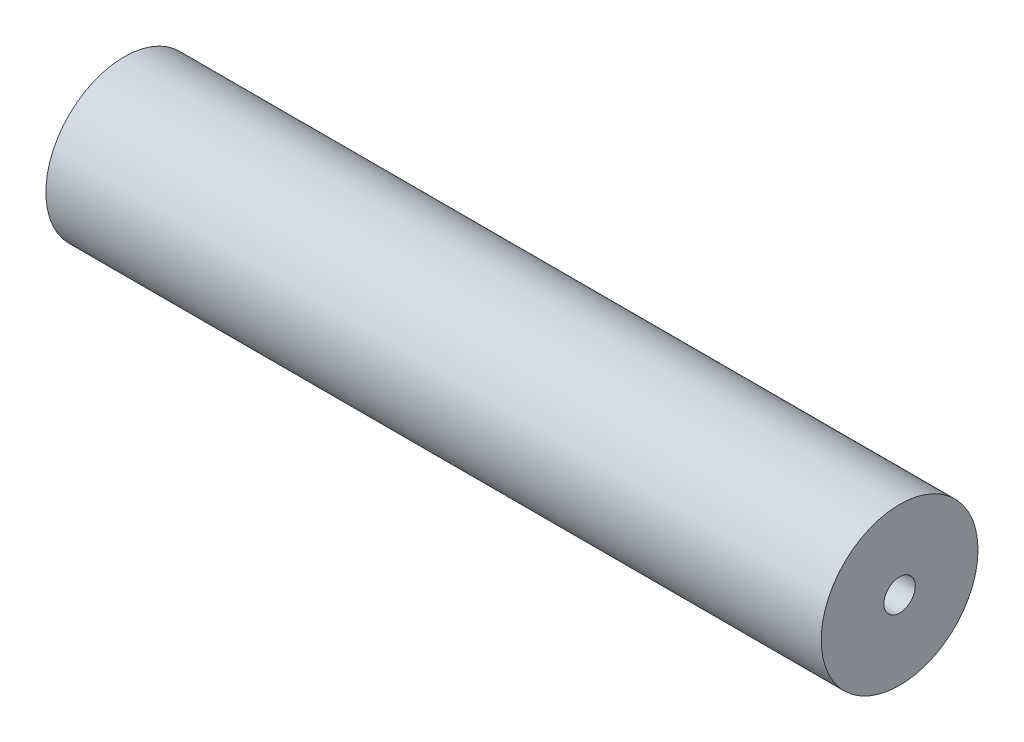
ISO-10303-21;
HEADER;
FILE_DESCRIPTION(('STEP AP214'),'2;1');
FILE_NAME('part.step','',(''),(''),'','','');
FILE_SCHEMA(('AUTOMOTIVE_DESIGN { 1 0 10303 214 1 1 1 1 }'));
ENDSEC;
DATA;
#1=APPLICATION_CONTEXT('core data for automotive mechanical design processes');
#2=APPLICATION_PROTOCOL_DEFINITION('international standard','automotive_design',2000,#1);
#3=PRODUCT_CONTEXT('',#1,'mechanical');
#4=PRODUCT('Part','Part','',(#3));
#5=PRODUCT_RELATED_PRODUCT_CATEGORY('part','',(#4));
#6=PRODUCT_DEFINITION_FORMATION('','',#4);
#7=PRODUCT_DEFINITION_CONTEXT('part definition',#1,'design');
#8=PRODUCT_DEFINITION('design','',#6,#7);
#9=PRODUCT_DEFINITION_SHAPE('','',#8);
#10=(LENGTH_UNIT() NAMED_UNIT(*) SI_UNIT(.MILLI.,.METRE.));
#11=(NAMED_UNIT(*) PLANE_ANGLE_UNIT() SI_UNIT($,.RADIAN.));
#12=(NAMED_UNIT(*) SI_UNIT($,.STERADIAN.) SOLID_ANGLE_UNIT());
#13=UNCERTAINTY_MEASURE_WITH_UNIT(LENGTH_MEASURE(1.E-05),#10,'distance_accuracy_value','');
#14=(GEOMETRIC_REPRESENTATION_CONTEXT(3) GLOBAL_UNCERTAINTY_ASSIGNED_CONTEXT((#13)) GLOBAL_UNIT_ASSIGNED_CONTEXT((#10,
#11,#12)) REPRESENTATION_CONTEXT('',''));
#15=CARTESIAN_POINT('',(0.,0.,0.));
#16=DIRECTION('',(0.,0.,1.));
#17=DIRECTION('',(1.,0.,0.));
#18=AXIS2_PLACEMENT_3D('',#15,#16,#17);
#19=CARTESIAN_POINT('',(0.,7.9375,0.));
#20=DIRECTION('',(-1.,0.,0.));
#21=DIRECTION('',(0.,0.,1.));
#22=AXIS2_PLACEMENT_3D('',#19,#20,#21);
#23=PLANE('',#22);
#24=CARTESIAN_POINT('',(0.,0.,0.));
#25=DIRECTION('',(1.,0.,0.));
#26=DIRECTION('',(0.,0.,-1.));
#27=AXIS2_PLACEMENT_3D('',#24,#25,#26);
#28=CIRCLE('',#27,1.5875);
#29=CARTESIAN_POINT('',(0.,0.,-1.5875));
#30=VERTEX_POINT('',#29);
#31=EDGE_CURVE('E12',#30,#30,#28,.T.);
#32=ORIENTED_EDGE('',*,*,#31,.T.);
#33=EDGE_LOOP('',(#32));
#34=FACE_BOUND('',#33,.T.);
#35=CARTESIAN_POINT('',(0.,0.,0.));
#36=DIRECTION('',(1.,0.,0.));
#37=DIRECTION('',(0.,0.,-1.));
#38=AXIS2_PLACEMENT_3D('',#35,#36,#37);
#39=CIRCLE('',#38,7.9375);
#40=CARTESIAN_POINT('',(0.,0.,-7.9375));
#41=VERTEX_POINT('',#40);
#42=EDGE_CURVE('E64',#41,#41,#39,.T.);
#43=ORIENTED_EDGE('',*,*,#42,.F.);
#44=EDGE_LOOP('',(#43));
#45=FACE_BOUND('',#44,.T.);
#46=ADVANCED_FACE('F42',(#34,#45),#23,.T.);
#47=CARTESIAN_POINT('',(0.,0.,0.));
#48=DIRECTION('',(1.,0.,0.));
#49=DIRECTION('',(0.,0.,-1.));
#50=AXIS2_PLACEMENT_3D('',#47,#48,#49);
#51=CYLINDRICAL_SURFACE('',#50,1.5875);
#52=CARTESIAN_POINT('',(10.,0.,0.));
#53=DIRECTION('',(1.,0.,0.));
#54=DIRECTION('',(0.,0.,-1.));
#55=AXIS2_PLACEMENT_3D('',#52,#53,#54);
#56=CIRCLE('',#55,1.5875);
#57=CARTESIAN_POINT('',(10.,0.,-1.5875));
#58=VERTEX_POINT('',#57);
#59=EDGE_CURVE('E48',#58,#58,#56,.T.);
#60=ORIENTED_EDGE('',*,*,#59,.T.);
#61=EDGE_LOOP('',(#60));
#62=FACE_BOUND('',#61,.T.);
#63=ORIENTED_EDGE('',*,*,#31,.F.);
#64=EDGE_LOOP('',(#63));
#65=FACE_BOUND('',#64,.T.);
#66=ADVANCED_FACE('F72',(#62,#65),#51,.F.);
#67=CARTESIAN_POINT('',(10.,0.,0.));
#68=DIRECTION('',(-1.,0.,0.));
#69=DIRECTION('',(0.,0.,1.));
#70=AXIS2_PLACEMENT_3D('',#67,#68,#69);
#71=PLANE('',#70);
#72=ORIENTED_EDGE('',*,*,#59,.F.);
#73=EDGE_LOOP('',(#72));
#74=FACE_BOUND('',#73,.T.);
#75=ADVANCED_FACE('F76',(#74),#71,.T.);
#76=CARTESIAN_POINT('',(68.5,1.5875,0.));
#77=DIRECTION('',(1.,0.,0.));
#78=DIRECTION('',(0.,0.,-1.));
#79=AXIS2_PLACEMENT_3D('',#76,#77,#78);
#80=PLANE('',#79);
#81=CARTESIAN_POINT('',(68.5,0.,0.));
#82=DIRECTION('',(1.,0.,0.));
#83=DIRECTION('',(0.,0.,-1.));
#84=AXIS2_PLACEMENT_3D('',#81,#82,#83);
#85=CIRCLE('',#84,1.5875);
#86=CARTESIAN_POINT('',(68.5,0.,-1.5875));
#87=VERTEX_POINT('',#86);
#88=EDGE_CURVE('E52',#87,#87,#85,.T.);
#89=ORIENTED_EDGE('',*,*,#88,.T.);
#90=EDGE_LOOP('',(#89));
#91=FACE_BOUND('',#90,.T.);
#92=ADVANCED_FACE('F80',(#91),#80,.T.);
#93=CARTESIAN_POINT('',(0.,0.,0.));
#94=DIRECTION('',(1.,0.,0.));
#95=DIRECTION('',(0.,0.,-1.));
#96=AXIS2_PLACEMENT_3D('',#93,#94,#95);
#97=CYLINDRICAL_SURFACE('',#96,1.5875);
#98=CARTESIAN_POINT('',(78.5,0.,0.));
#99=DIRECTION('',(1.,0.,0.));
#100=DIRECTION('',(0.,0.,-1.));
#101=AXIS2_PLACEMENT_3D('',#98,#99,#100);
#102=CIRCLE('',#101,1.5875);
#103=CARTESIAN_POINT('',(78.5,0.,-1.5875));
#104=VERTEX_POINT('',#103);
#105=EDGE_CURVE('E56',#104,#104,#102,.T.);
#106=ORIENTED_EDGE('',*,*,#105,.T.);
#107=EDGE_LOOP('',(#106));
#108=FACE_BOUND('',#107,.T.);
#109=ORIENTED_EDGE('',*,*,#88,.F.);
#110=EDGE_LOOP('',(#109));
#111=FACE_BOUND('',#110,.T.);
#112=ADVANCED_FACE('F87',(#108,#111),#97,.F.);
#113=CARTESIAN_POINT('',(78.5,7.9375,0.));
#114=DIRECTION('',(1.,0.,0.));
#115=DIRECTION('',(0.,0.,-1.));
#116=AXIS2_PLACEMENT_3D('',#113,#114,#115);
#117=PLANE('',#116);
#118=CARTESIAN_POINT('',(78.5,0.,0.));
#119=DIRECTION('',(1.,0.,0.));
#120=DIRECTION('',(0.,0.,-1.));
#121=AXIS2_PLACEMENT_3D('',#118,#119,#120);
#122=CIRCLE('',#121,7.9375);
#123=CARTESIAN_POINT('',(78.5,0.,-7.9375));
#124=VERTEX_POINT('',#123);
#125=EDGE_CURVE('E61',#124,#124,#122,.T.);
#126=ORIENTED_EDGE('',*,*,#125,.T.);
#127=EDGE_LOOP('',(#126));
#128=FACE_BOUND('',#127,.T.);
#129=ORIENTED_EDGE('',*,*,#105,.F.);
#130=EDGE_LOOP('',(#129));
#131=FACE_BOUND('',#130,.T.);
#132=ADVANCED_FACE('F91',(#128,#131),#117,.T.);
#133=CARTESIAN_POINT('',(0.,0.,0.));
#134=DIRECTION('',(1.,0.,0.));
#135=DIRECTION('',(0.,0.,-1.));
#136=AXIS2_PLACEMENT_3D('',#133,#134,#135);
#137=CYLINDRICAL_SURFACE('',#136,7.9375);
#138=ORIENTED_EDGE('',*,*,#42,.T.);
#139=EDGE_LOOP('',(#138));
#140=FACE_BOUND('',#139,.T.);
#141=ORIENTED_EDGE('',*,*,#125,.F.);
#142=EDGE_LOOP('',(#141));
#143=FACE_BOUND('',#142,.T.);
#144=ADVANCED_FACE('F68',(#140,#143),#137,.T.);
#145=CLOSED_SHELL('',(#46,#66,#75,#92,#112,#132,#144));
#146=MANIFOLD_SOLID_BREP('B2',#145);
#147=ADVANCED_BREP_SHAPE_REPRESENTATION('',(#18,#146),#14);
#148=SHAPE_DEFINITION_REPRESENTATION(#9,#147);
ENDSEC;
END-ISO-10303-21;
